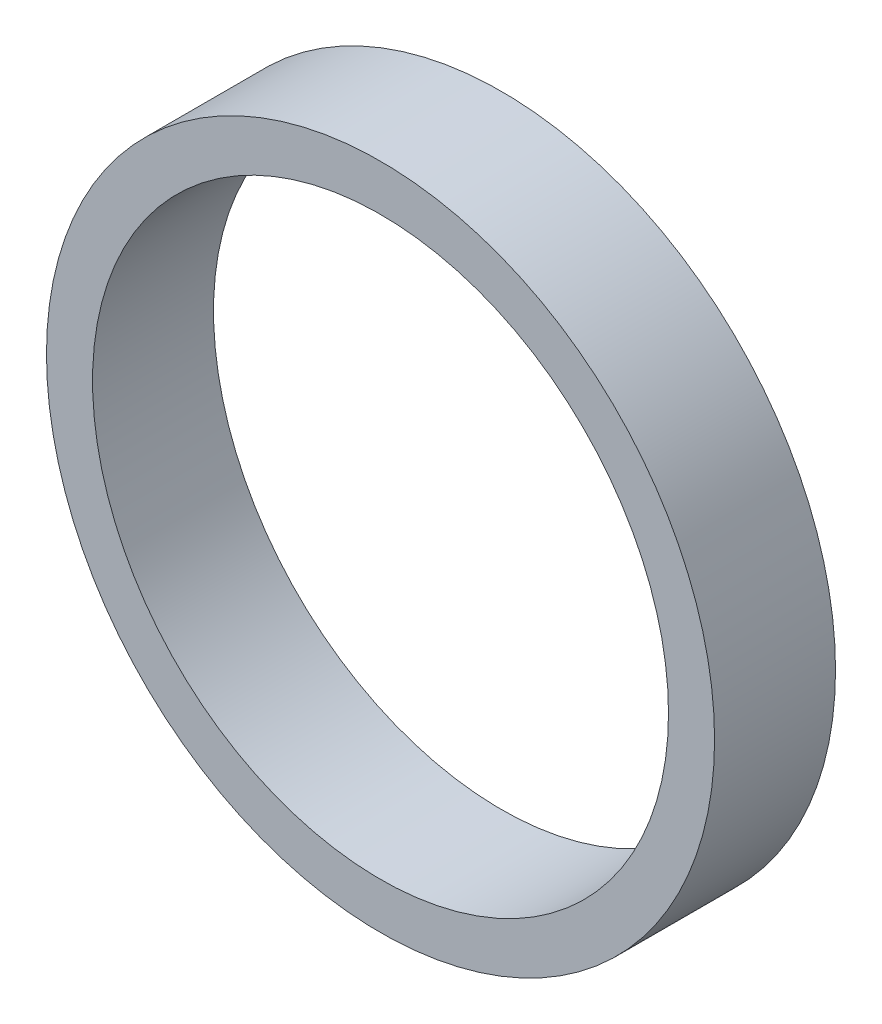
ISO-10303-21;
HEADER;
FILE_DESCRIPTION(('STEP AP214'),'2;1');
FILE_NAME('part.step','',(''),(''),'','','');
FILE_SCHEMA(('AUTOMOTIVE_DESIGN { 1 0 10303 214 1 1 1 1 }'));
ENDSEC;
DATA;
#1=APPLICATION_CONTEXT('core data for automotive mechanical design processes');
#2=APPLICATION_PROTOCOL_DEFINITION('international standard','automotive_design',2000,#1);
#3=PRODUCT_CONTEXT('',#1,'mechanical');
#4=PRODUCT('Part','Part','',(#3));
#5=PRODUCT_RELATED_PRODUCT_CATEGORY('part','',(#4));
#6=PRODUCT_DEFINITION_FORMATION('','',#4);
#7=PRODUCT_DEFINITION_CONTEXT('part definition',#1,'design');
#8=PRODUCT_DEFINITION('design','',#6,#7);
#9=PRODUCT_DEFINITION_SHAPE('','',#8);
#10=(LENGTH_UNIT() NAMED_UNIT(*) SI_UNIT(.MILLI.,.METRE.));
#11=(NAMED_UNIT(*) PLANE_ANGLE_UNIT() SI_UNIT($,.RADIAN.));
#12=(NAMED_UNIT(*) SI_UNIT($,.STERADIAN.) SOLID_ANGLE_UNIT());
#13=UNCERTAINTY_MEASURE_WITH_UNIT(LENGTH_MEASURE(1.E-05),#10,'distance_accuracy_value','');
#14=(GEOMETRIC_REPRESENTATION_CONTEXT(3) GLOBAL_UNCERTAINTY_ASSIGNED_CONTEXT((#13)) GLOBAL_UNIT_ASSIGNED_CONTEXT((#10,
#11,#12)) REPRESENTATION_CONTEXT('',''));
#15=CARTESIAN_POINT('',(0.,0.,0.));
#16=DIRECTION('',(0.,0.,1.));
#17=DIRECTION('',(1.,0.,0.));
#18=AXIS2_PLACEMENT_3D('',#15,#16,#17);
#19=CARTESIAN_POINT('',(0.,0.,5.25));
#20=DIRECTION('',(0.,0.,1.));
#21=DIRECTION('',(1.,0.,0.));
#22=AXIS2_PLACEMENT_3D('',#19,#20,#21);
#23=PLANE('',#22);
#24=CARTESIAN_POINT('',(0.,0.,5.25));
#25=DIRECTION('',(0.,0.,1.));
#26=DIRECTION('',(1.,0.,0.));
#27=AXIS2_PLACEMENT_3D('',#24,#25,#26);
#28=CIRCLE('',#27,14.5);
#29=CARTESIAN_POINT('',(14.5,0.,5.25));
#30=VERTEX_POINT('',#29);
#31=EDGE_CURVE('E10',#30,#30,#28,.T.);
#32=ORIENTED_EDGE('',*,*,#31,.T.);
#33=EDGE_LOOP('',(#32));
#34=FACE_BOUND('',#33,.T.);
#35=CARTESIAN_POINT('',(0.,0.,5.25));
#36=DIRECTION('',(0.,0.,1.));
#37=DIRECTION('',(1.,0.,0.));
#38=AXIS2_PLACEMENT_3D('',#35,#36,#37);
#39=CIRCLE('',#38,12.5);
#40=CARTESIAN_POINT('',(12.5,0.,5.25));
#41=VERTEX_POINT('',#40);
#42=EDGE_CURVE('E41',#41,#41,#39,.T.);
#43=ORIENTED_EDGE('',*,*,#42,.F.);
#44=EDGE_LOOP('',(#43));
#45=FACE_BOUND('',#44,.T.);
#46=ADVANCED_FACE('F30',(#34,#45),#23,.T.);
#47=CARTESIAN_POINT('',(0.,0.,0.));
#48=DIRECTION('',(0.,0.,1.));
#49=DIRECTION('',(1.,0.,0.));
#50=AXIS2_PLACEMENT_3D('',#47,#48,#49);
#51=PLANE('',#50);
#52=CARTESIAN_POINT('',(0.,0.,0.));
#53=DIRECTION('',(0.,0.,1.));
#54=DIRECTION('',(1.,0.,0.));
#55=AXIS2_PLACEMENT_3D('',#52,#53,#54);
#56=CIRCLE('',#55,14.5);
#57=CARTESIAN_POINT('',(14.5,0.,0.));
#58=VERTEX_POINT('',#57);
#59=EDGE_CURVE('E34',#58,#58,#56,.T.);
#60=ORIENTED_EDGE('',*,*,#59,.F.);
#61=EDGE_LOOP('',(#60));
#62=FACE_BOUND('',#61,.T.);
#63=CARTESIAN_POINT('',(0.,0.,0.));
#64=DIRECTION('',(0.,0.,1.));
#65=DIRECTION('',(1.,0.,0.));
#66=AXIS2_PLACEMENT_3D('',#63,#64,#65);
#67=CIRCLE('',#66,12.5);
#68=CARTESIAN_POINT('',(12.5,0.,0.));
#69=VERTEX_POINT('',#68);
#70=EDGE_CURVE('E43',#69,#69,#67,.T.);
#71=ORIENTED_EDGE('',*,*,#70,.T.);
#72=EDGE_LOOP('',(#71));
#73=FACE_BOUND('',#72,.T.);
#74=ADVANCED_FACE('F53',(#62,#73),#51,.F.);
#75=CARTESIAN_POINT('',(0.,0.,5.25));
#76=DIRECTION('',(0.,0.,-1.));
#77=DIRECTION('',(-1.,0.,0.));
#78=AXIS2_PLACEMENT_3D('',#75,#76,#77);
#79=CYLINDRICAL_SURFACE('',#78,14.5);
#80=ORIENTED_EDGE('',*,*,#31,.F.);
#81=EDGE_LOOP('',(#80));
#82=FACE_BOUND('',#81,.T.);
#83=ORIENTED_EDGE('',*,*,#59,.T.);
#84=EDGE_LOOP('',(#83));
#85=FACE_BOUND('',#84,.T.);
#86=ADVANCED_FACE('F32',(#82,#85),#79,.T.);
#87=CARTESIAN_POINT('',(0.,0.,5.25));
#88=DIRECTION('',(0.,0.,-1.));
#89=DIRECTION('',(-1.,0.,0.));
#90=AXIS2_PLACEMENT_3D('',#87,#88,#89);
#91=CYLINDRICAL_SURFACE('',#90,12.5);
#92=ORIENTED_EDGE('',*,*,#42,.T.);
#93=EDGE_LOOP('',(#92));
#94=FACE_BOUND('',#93,.T.);
#95=ORIENTED_EDGE('',*,*,#70,.F.);
#96=EDGE_LOOP('',(#95));
#97=FACE_BOUND('',#96,.T.);
#98=ADVANCED_FACE('F49',(#94,#97),#91,.F.);
#99=CLOSED_SHELL('',(#46,#74,#86,#98));
#100=MANIFOLD_SOLID_BREP('B2',#99);
#101=ADVANCED_BREP_SHAPE_REPRESENTATION('',(#18,#100),#14);
#102=SHAPE_DEFINITION_REPRESENTATION(#9,#101);
ENDSEC;
END-ISO-10303-21;
